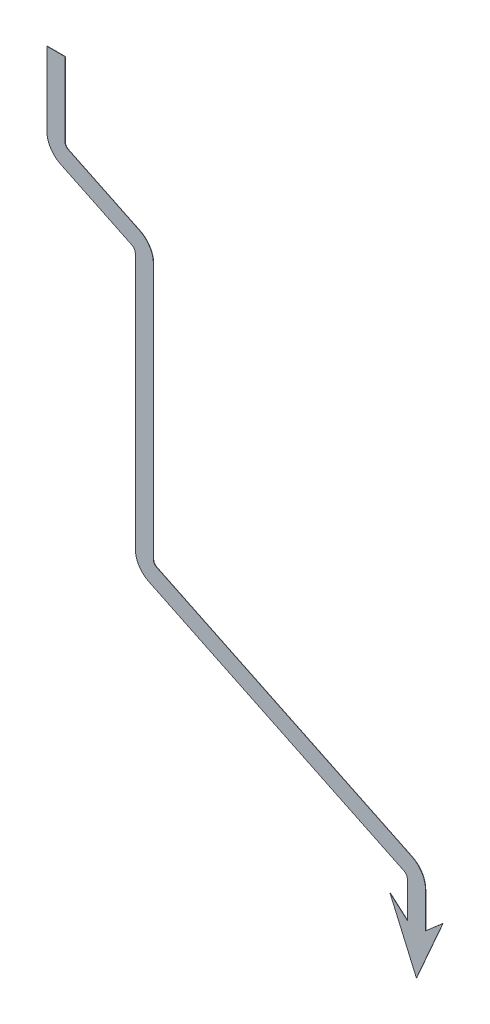
ISO-10303-21;
HEADER;
FILE_DESCRIPTION(('STEP AP214'),'2;1');
FILE_NAME('part.step','',(''),(''),'','','');
FILE_SCHEMA(('AUTOMOTIVE_DESIGN { 1 0 10303 214 1 1 1 1 }'));
ENDSEC;
DATA;
#1=APPLICATION_CONTEXT('core data for automotive mechanical design processes');
#2=APPLICATION_PROTOCOL_DEFINITION('international standard','automotive_design',2000,#1);
#3=PRODUCT_CONTEXT('',#1,'mechanical');
#4=PRODUCT('Part','Part','',(#3));
#5=PRODUCT_RELATED_PRODUCT_CATEGORY('part','',(#4));
#6=PRODUCT_DEFINITION_FORMATION('','',#4);
#7=PRODUCT_DEFINITION_CONTEXT('part definition',#1,'design');
#8=PRODUCT_DEFINITION('design','',#6,#7);
#9=PRODUCT_DEFINITION_SHAPE('','',#8);
#10=(LENGTH_UNIT() NAMED_UNIT(*) SI_UNIT(.MILLI.,.METRE.));
#11=(NAMED_UNIT(*) PLANE_ANGLE_UNIT() SI_UNIT($,.RADIAN.));
#12=(NAMED_UNIT(*) SI_UNIT($,.STERADIAN.) SOLID_ANGLE_UNIT());
#13=UNCERTAINTY_MEASURE_WITH_UNIT(LENGTH_MEASURE(1.E-05),#10,'distance_accuracy_value','');
#14=(GEOMETRIC_REPRESENTATION_CONTEXT(3) GLOBAL_UNCERTAINTY_ASSIGNED_CONTEXT((#13)) GLOBAL_UNIT_ASSIGNED_CONTEXT((#10,
#11,#12)) REPRESENTATION_CONTEXT('',''));
#15=CARTESIAN_POINT('',(0.,0.,0.));
#16=DIRECTION('',(0.,0.,1.));
#17=DIRECTION('',(1.,0.,0.));
#18=AXIS2_PLACEMENT_3D('',#15,#16,#17);
#19=CARTESIAN_POINT('',(170.725807144726,-184.211001687982,0.2));
#20=DIRECTION('',(1.,0.,0.));
#21=DIRECTION('',(0.,1.,0.));
#22=AXIS2_PLACEMENT_3D('',#19,#20,#21);
#23=PLANE('',#22);
#24=DIRECTION('',(0.,-1.,0.));
#25=VECTOR('',#24,1.);
#26=CARTESIAN_POINT('',(170.725807144726,-184.211001687982,0.));
#27=LINE('',#26,#25);
#28=CARTESIAN_POINT('',(170.725807144726,-184.211001687982,0.));
#29=VERTEX_POINT('',#28);
#30=CARTESIAN_POINT('',(170.725807144726,-207.92823917455,0.));
#31=VERTEX_POINT('',#30);
#32=EDGE_CURVE('E219',#29,#31,#27,.T.);
#33=ORIENTED_EDGE('',*,*,#32,.T.);
#34=DIRECTION('',(0.,0.,-1.));
#35=VECTOR('',#34,1.);
#36=CARTESIAN_POINT('',(170.725807144726,-207.92823917455,0.2));
#37=LINE('',#36,#35);
#38=CARTESIAN_POINT('',(170.725807144726,-207.92823917455,0.199999999999999));
#39=VERTEX_POINT('',#38);
#40=EDGE_CURVE('E11',#39,#31,#37,.T.);
#41=ORIENTED_EDGE('',*,*,#40,.F.);
#42=DIRECTION('',(0.,-1.,0.));
#43=VECTOR('',#42,1.);
#44=CARTESIAN_POINT('',(170.725807144726,-184.211001687982,0.2));
#45=LINE('',#44,#43);
#46=CARTESIAN_POINT('',(170.725807144726,-184.211001687982,0.2));
#47=VERTEX_POINT('',#46);
#48=EDGE_CURVE('E272',#47,#39,#45,.T.);
#49=ORIENTED_EDGE('',*,*,#48,.F.);
#50=DIRECTION('',(0.,0.,-1.));
#51=VECTOR('',#50,1.);
#52=CARTESIAN_POINT('',(170.725807144726,-184.211001687982,0.2));
#53=LINE('',#52,#51);
#54=EDGE_CURVE('E317',#47,#29,#53,.T.);
#55=ORIENTED_EDGE('',*,*,#54,.T.);
#56=EDGE_LOOP('',(#33,#41,#49,#55));
#57=FACE_BOUND('',#56,.T.);
#58=ADVANCED_FACE('F33',(#57),#23,.F.);
#59=CARTESIAN_POINT('',(182.725807144726,-184.211001687982,0.2));
#60=DIRECTION('',(1.,0.,0.));
#61=DIRECTION('',(0.,1.,0.));
#62=AXIS2_PLACEMENT_3D('',#59,#60,#61);
#63=PLANE('',#62);
#64=DIRECTION('',(0.,-1.,0.));
#65=VECTOR('',#64,1.);
#66=CARTESIAN_POINT('',(182.725807144726,-184.211001687982,0.));
#67=LINE('',#66,#65);
#68=CARTESIAN_POINT('',(182.725807144726,-184.211001687982,0.));
#69=VERTEX_POINT('',#68);
#70=CARTESIAN_POINT('',(182.725807144726,-207.92823917455,0.));
#71=VERTEX_POINT('',#70);
#72=EDGE_CURVE('E226',#69,#71,#67,.T.);
#73=ORIENTED_EDGE('',*,*,#72,.F.);
#74=DIRECTION('',(0.,0.,-1.));
#75=VECTOR('',#74,1.);
#76=CARTESIAN_POINT('',(182.725807144726,-184.211001687982,0.2));
#77=LINE('',#76,#75);
#78=CARTESIAN_POINT('',(182.725807144726,-184.211001687982,0.2));
#79=VERTEX_POINT('',#78);
#80=EDGE_CURVE('E359',#79,#69,#77,.T.);
#81=ORIENTED_EDGE('',*,*,#80,.F.);
#82=DIRECTION('',(0.,-1.,0.));
#83=VECTOR('',#82,1.);
#84=CARTESIAN_POINT('',(182.725807144726,-184.211001687982,0.2));
#85=LINE('',#84,#83);
#86=CARTESIAN_POINT('',(182.725807144726,-207.92823917455,0.199999999999999));
#87=VERTEX_POINT('',#86);
#88=EDGE_CURVE('E274',#79,#87,#85,.T.);
#89=ORIENTED_EDGE('',*,*,#88,.T.);
#90=DIRECTION('',(0.,0.,-1.));
#91=VECTOR('',#90,1.);
#92=CARTESIAN_POINT('',(182.725807144726,-207.92823917455,0.2));
#93=LINE('',#92,#91);
#94=EDGE_CURVE('E40',#87,#71,#93,.T.);
#95=ORIENTED_EDGE('',*,*,#94,.T.);
#96=EDGE_LOOP('',(#73,#81,#89,#95));
#97=FACE_BOUND('',#96,.T.);
#98=ADVANCED_FACE('F362',(#97),#63,.T.);
#99=CARTESIAN_POINT('',(166.725807144726,-184.211001687982,0.2));
#100=DIRECTION('',(0.,0.,-1.));
#101=DIRECTION('',(-1.,0.,0.));
#102=AXIS2_PLACEMENT_3D('',#99,#100,#101);
#103=CYLINDRICAL_SURFACE('',#102,16.);
#104=CARTESIAN_POINT('',(166.725807144726,-184.211001687982,0.));
#105=DIRECTION('',(0.,0.,1.));
#106=DIRECTION('',(1.,0.,0.));
#107=AXIS2_PLACEMENT_3D('',#104,#105,#106);
#108=CIRCLE('',#107,16.);
#109=CARTESIAN_POINT('',(173.669298684435,-169.796150830689,0.));
#110=VERTEX_POINT('',#109);
#111=EDGE_CURVE('E229',#110,#69,#108,.F.);
#112=ORIENTED_EDGE('',*,*,#111,.F.);
#113=DIRECTION('',(0.,0.,-1.));
#114=VECTOR('',#113,1.);
#115=CARTESIAN_POINT('',(173.669298684435,-169.796150830689,0.2));
#116=LINE('',#115,#114);
#117=CARTESIAN_POINT('',(173.669298684435,-169.796150830689,0.2));
#118=VERTEX_POINT('',#117);
#119=EDGE_CURVE('E357',#118,#110,#116,.T.);
#120=ORIENTED_EDGE('',*,*,#119,.F.);
#121=CARTESIAN_POINT('',(166.725807144726,-184.211001687982,0.2));
#122=DIRECTION('',(0.,0.,1.));
#123=DIRECTION('',(1.,0.,0.));
#124=AXIS2_PLACEMENT_3D('',#121,#122,#123);
#125=CIRCLE('',#124,16.);
#126=EDGE_CURVE('E276',#118,#79,#125,.F.);
#127=ORIENTED_EDGE('',*,*,#126,.T.);
#128=ORIENTED_EDGE('',*,*,#80,.T.);
#129=EDGE_LOOP('',(#112,#120,#127,#128));
#130=FACE_BOUND('',#129,.T.);
#131=ADVANCED_FACE('F369',(#130),#103,.T.);
#132=CARTESIAN_POINT('',(4.80429854364468,-88.4555451290707,0.2));
#133=DIRECTION('',(0.433968221231855,0.900928178580768,0.));
#134=DIRECTION('',(-0.900928178580768,0.433968221231855,0.));
#135=AXIS2_PLACEMENT_3D('',#132,#133,#134);
#136=PLANE('',#135);
#137=DIRECTION('',(0.900928178580768,-0.433968221231855,0.));
#138=VECTOR('',#137,1.);
#139=CARTESIAN_POINT('',(4.80429854364468,-88.4555451290707,0.));
#140=LINE('',#139,#138);
#141=CARTESIAN_POINT('',(4.80429854364469,-88.4555451290707,0.));
#142=VERTEX_POINT('',#141);
#143=EDGE_CURVE('E232',#142,#110,#140,.T.);
#144=ORIENTED_EDGE('',*,*,#143,.F.);
#145=DIRECTION('',(0.,0.,-1.));
#146=VECTOR('',#145,1.);
#147=CARTESIAN_POINT('',(4.80429854364469,-88.4555451290707,0.2));
#148=LINE('',#147,#146);
#149=CARTESIAN_POINT('',(4.80429854364469,-88.4555451290707,0.2));
#150=VERTEX_POINT('',#149);
#151=EDGE_CURVE('E355',#150,#142,#148,.T.);
#152=ORIENTED_EDGE('',*,*,#151,.F.);
#153=DIRECTION('',(0.900928178580768,-0.433968221231855,0.));
#154=VECTOR('',#153,1.);
#155=CARTESIAN_POINT('',(4.80429854364468,-88.4555451290707,0.2));
#156=LINE('',#155,#154);
#157=EDGE_CURVE('E279',#150,#118,#156,.T.);
#158=ORIENTED_EDGE('',*,*,#157,.T.);
#159=ORIENTED_EDGE('',*,*,#119,.T.);
#160=EDGE_LOOP('',(#144,#152,#158,#159));
#161=FACE_BOUND('',#160,.T.);
#162=ADVANCED_FACE('F374',(#161),#136,.T.);
#163=CARTESIAN_POINT('',(6.54017142857211,-84.8518324147476,0.2));
#164=DIRECTION('',(0.,0.,-1.));
#165=DIRECTION('',(-1.,0.,0.));
#166=AXIS2_PLACEMENT_3D('',#163,#164,#165);
#167=CYLINDRICAL_SURFACE('',#166,4.00000000000001);
#168=CARTESIAN_POINT('',(6.54017142857211,-84.8518324147476,0.));
#169=DIRECTION('',(0.,0.,1.));
#170=DIRECTION('',(1.,0.,0.));
#171=AXIS2_PLACEMENT_3D('',#168,#169,#170);
#172=CIRCLE('',#171,4.00000000000001);
#173=CARTESIAN_POINT('',(2.5401714285721,-84.8518324147476,0.));
#174=VERTEX_POINT('',#173);
#175=EDGE_CURVE('E235',#174,#142,#172,.T.);
#176=ORIENTED_EDGE('',*,*,#175,.F.);
#177=DIRECTION('',(0.,0.,-1.));
#178=VECTOR('',#177,1.);
#179=CARTESIAN_POINT('',(2.5401714285721,-84.8518324147476,0.2));
#180=LINE('',#179,#178);
#181=CARTESIAN_POINT('',(2.5401714285721,-84.8518324147476,0.2));
#182=VERTEX_POINT('',#181);
#183=EDGE_CURVE('E353',#182,#174,#180,.T.);
#184=ORIENTED_EDGE('',*,*,#183,.F.);
#185=CARTESIAN_POINT('',(6.54017142857211,-84.8518324147476,0.2));
#186=DIRECTION('',(0.,0.,1.));
#187=DIRECTION('',(1.,0.,0.));
#188=AXIS2_PLACEMENT_3D('',#185,#186,#187);
#189=CIRCLE('',#188,4.00000000000001);
#190=EDGE_CURVE('E282',#182,#150,#189,.T.);
#191=ORIENTED_EDGE('',*,*,#190,.T.);
#192=ORIENTED_EDGE('',*,*,#151,.T.);
#193=EDGE_LOOP('',(#176,#184,#191,#192));
#194=FACE_BOUND('',#193,.T.);
#195=ADVANCED_FACE('F377',(#194),#167,.F.);
#196=CARTESIAN_POINT('',(2.54017142857209,84.6453937828702,0.2));
#197=DIRECTION('',(1.,0.,0.));
#198=DIRECTION('',(0.,1.,0.));
#199=AXIS2_PLACEMENT_3D('',#196,#197,#198);
#200=PLANE('',#199);
#201=DIRECTION('',(0.,-1.,0.));
#202=VECTOR('',#201,1.);
#203=CARTESIAN_POINT('',(2.54017142857209,84.6453937828702,0.));
#204=LINE('',#203,#202);
#205=CARTESIAN_POINT('',(2.54017142857209,84.6453937828702,0.));
#206=VERTEX_POINT('',#205);
#207=EDGE_CURVE('E238',#206,#174,#204,.T.);
#208=ORIENTED_EDGE('',*,*,#207,.F.);
#209=DIRECTION('',(0.,0.,-1.));
#210=VECTOR('',#209,1.);
#211=CARTESIAN_POINT('',(2.54017142857209,84.6453937828702,0.2));
#212=LINE('',#211,#210);
#213=CARTESIAN_POINT('',(2.54017142857209,84.6453937828702,0.2));
#214=VERTEX_POINT('',#213);
#215=EDGE_CURVE('E351',#214,#206,#212,.T.);
#216=ORIENTED_EDGE('',*,*,#215,.F.);
#217=DIRECTION('',(0.,-1.,0.));
#218=VECTOR('',#217,1.);
#219=CARTESIAN_POINT('',(2.54017142857209,84.6453937828702,0.2));
#220=LINE('',#219,#218);
#221=EDGE_CURVE('E285',#214,#182,#220,.T.);
#222=ORIENTED_EDGE('',*,*,#221,.T.);
#223=ORIENTED_EDGE('',*,*,#183,.T.);
#224=EDGE_LOOP('',(#208,#216,#222,#223));
#225=FACE_BOUND('',#224,.T.);
#226=ADVANCED_FACE('F382',(#225),#200,.T.);
#227=CARTESIAN_POINT('',(-13.4598285714286,84.6453937828704,0.2));
#228=DIRECTION('',(0.,0.,-1.));
#229=DIRECTION('',(-1.,0.,0.));
#230=AXIS2_PLACEMENT_3D('',#227,#228,#229);
#231=CYLINDRICAL_SURFACE('',#230,16.0000000000004);
#232=CARTESIAN_POINT('',(-13.4598285714286,84.6453937828704,0.));
#233=DIRECTION('',(0.,0.,1.));
#234=DIRECTION('',(1.,0.,0.));
#235=AXIS2_PLACEMENT_3D('',#232,#233,#234);
#236=CIRCLE('',#235,16.0000000000004);
#237=CARTESIAN_POINT('',(-6.51633703171772,99.0602446401626,0.));
#238=VERTEX_POINT('',#237);
#239=EDGE_CURVE('E241',#238,#206,#236,.F.);
#240=ORIENTED_EDGE('',*,*,#239,.F.);
#241=DIRECTION('',(0.,0.,-1.));
#242=VECTOR('',#241,1.);
#243=CARTESIAN_POINT('',(-6.51633703171772,99.0602446401626,0.2));
#244=LINE('',#243,#242);
#245=CARTESIAN_POINT('',(-6.51633703171772,99.0602446401626,0.2));
#246=VERTEX_POINT('',#245);
#247=EDGE_CURVE('E349',#246,#238,#244,.T.);
#248=ORIENTED_EDGE('',*,*,#247,.F.);
#249=CARTESIAN_POINT('',(-13.4598285714286,84.6453937828704,0.2));
#250=DIRECTION('',(0.,0.,1.));
#251=DIRECTION('',(1.,0.,0.));
#252=AXIS2_PLACEMENT_3D('',#249,#250,#251);
#253=CIRCLE('',#252,16.0000000000004);
#254=EDGE_CURVE('E288',#246,#214,#253,.F.);
#255=ORIENTED_EDGE('',*,*,#254,.T.);
#256=ORIENTED_EDGE('',*,*,#215,.T.);
#257=EDGE_LOOP('',(#240,#248,#255,#256));
#258=FACE_BOUND('',#257,.T.);
#259=ADVANCED_FACE('F385',(#258),#231,.T.);
#260=CARTESIAN_POINT('',(-53.7560330641053,121.815140475481,0.2));
#261=DIRECTION('',(0.433968221231854,0.900928178580768,0.));
#262=DIRECTION('',(-0.900928178580768,0.433968221231854,0.));
#263=AXIS2_PLACEMENT_3D('',#260,#261,#262);
#264=PLANE('',#263);
#265=DIRECTION('',(0.900928178580768,-0.433968221231854,0.));
#266=VECTOR('',#265,1.);
#267=CARTESIAN_POINT('',(-53.7560330641053,121.815140475481,0.));
#268=LINE('',#267,#266);
#269=CARTESIAN_POINT('',(-53.7560330641053,121.815140475481,0.));
#270=VERTEX_POINT('',#269);
#271=EDGE_CURVE('E244',#270,#238,#268,.T.);
#272=ORIENTED_EDGE('',*,*,#271,.F.);
#273=DIRECTION('',(0.,0.,-1.));
#274=VECTOR('',#273,1.);
#275=CARTESIAN_POINT('',(-53.7560330641053,121.815140475481,0.2));
#276=LINE('',#275,#274);
#277=CARTESIAN_POINT('',(-53.7560330641053,121.815140475481,0.2));
#278=VERTEX_POINT('',#277);
#279=EDGE_CURVE('E347',#278,#270,#276,.T.);
#280=ORIENTED_EDGE('',*,*,#279,.F.);
#281=DIRECTION('',(0.900928178580768,-0.433968221231854,0.));
#282=VECTOR('',#281,1.);
#283=CARTESIAN_POINT('',(-53.7560330641053,121.815140475481,0.2));
#284=LINE('',#283,#282);
#285=EDGE_CURVE('E291',#278,#246,#284,.T.);
#286=ORIENTED_EDGE('',*,*,#285,.T.);
#287=ORIENTED_EDGE('',*,*,#247,.T.);
#288=EDGE_LOOP('',(#272,#280,#286,#287));
#289=FACE_BOUND('',#288,.T.);
#290=ADVANCED_FACE('F390',(#289),#264,.T.);
#291=CARTESIAN_POINT('',(-52.0201601791785,125.418853189804,0.2));
#292=DIRECTION('',(0.,0.,-1.));
#293=DIRECTION('',(-1.,0.,0.));
#294=AXIS2_PLACEMENT_3D('',#291,#292,#293);
#295=CYLINDRICAL_SURFACE('',#294,3.99999999999969);
#296=CARTESIAN_POINT('',(-52.0201601791785,125.418853189804,0.));
#297=DIRECTION('',(0.,0.,1.));
#298=DIRECTION('',(1.,0.,0.));
#299=AXIS2_PLACEMENT_3D('',#296,#297,#298);
#300=CIRCLE('',#299,3.99999999999969);
#301=CARTESIAN_POINT('',(-56.0201601791782,125.418853189804,0.));
#302=VERTEX_POINT('',#301);
#303=EDGE_CURVE('E247',#302,#270,#300,.T.);
#304=ORIENTED_EDGE('',*,*,#303,.F.);
#305=DIRECTION('',(0.,0.,-1.));
#306=VECTOR('',#305,1.);
#307=CARTESIAN_POINT('',(-56.0201601791782,125.418853189804,0.2));
#308=LINE('',#307,#306);
#309=CARTESIAN_POINT('',(-56.0201601791782,125.418853189804,0.2));
#310=VERTEX_POINT('',#309);
#311=EDGE_CURVE('E345',#310,#302,#308,.T.);
#312=ORIENTED_EDGE('',*,*,#311,.F.);
#313=CARTESIAN_POINT('',(-52.0201601791785,125.418853189804,0.2));
#314=DIRECTION('',(0.,0.,1.));
#315=DIRECTION('',(1.,0.,0.));
#316=AXIS2_PLACEMENT_3D('',#313,#314,#315);
#317=CIRCLE('',#316,3.99999999999969);
#318=EDGE_CURVE('E294',#310,#278,#317,.T.);
#319=ORIENTED_EDGE('',*,*,#318,.T.);
#320=ORIENTED_EDGE('',*,*,#279,.T.);
#321=EDGE_LOOP('',(#304,#312,#319,#320));
#322=FACE_BOUND('',#321,.T.);
#323=ADVANCED_FACE('F393',(#322),#295,.F.);
#324=CARTESIAN_POINT('',(-56.0201601791779,125.418853189804,0.2));
#325=DIRECTION('',(1.,0.,0.));
#326=DIRECTION('',(0.,1.,0.));
#327=AXIS2_PLACEMENT_3D('',#324,#325,#326);
#328=PLANE('',#327);
#329=DIRECTION('',(0.,-1.,0.));
#330=VECTOR('',#329,1.);
#331=CARTESIAN_POINT('',(-56.0201601791779,125.418853189804,0.));
#332=LINE('',#331,#330);
#333=CARTESIAN_POINT('',(-56.0201601791778,174.136090676372,0.));
#334=VERTEX_POINT('',#333);
#335=EDGE_CURVE('E250',#334,#302,#332,.T.);
#336=ORIENTED_EDGE('',*,*,#335,.F.);
#337=DIRECTION('',(0.,0.,-1.));
#338=VECTOR('',#337,1.);
#339=CARTESIAN_POINT('',(-56.0201601791778,174.136090676372,0.2));
#340=LINE('',#339,#338);
#341=CARTESIAN_POINT('',(-56.0201601791778,174.136090676372,0.2));
#342=VERTEX_POINT('',#341);
#343=EDGE_CURVE('E343',#342,#334,#340,.T.);
#344=ORIENTED_EDGE('',*,*,#343,.F.);
#345=DIRECTION('',(0.,-1.,0.));
#346=VECTOR('',#345,1.);
#347=CARTESIAN_POINT('',(-56.0201601791779,125.418853189804,0.2));
#348=LINE('',#347,#346);
#349=EDGE_CURVE('E297',#342,#310,#348,.T.);
#350=ORIENTED_EDGE('',*,*,#349,.T.);
#351=ORIENTED_EDGE('',*,*,#311,.T.);
#352=EDGE_LOOP('',(#336,#344,#350,#351));
#353=FACE_BOUND('',#352,.T.);
#354=ADVANCED_FACE('F398',(#353),#328,.T.);
#355=CARTESIAN_POINT('',(-68.0201601791778,174.136090676372,0.2));
#356=DIRECTION('',(0.,1.,0.));
#357=DIRECTION('',(0.,0.,1.));
#358=AXIS2_PLACEMENT_3D('',#355,#356,#357);
#359=PLANE('',#358);
#360=DIRECTION('',(1.,0.,0.));
#361=VECTOR('',#360,1.);
#362=CARTESIAN_POINT('',(-68.0201601791778,174.136090676372,0.));
#363=LINE('',#362,#361);
#364=CARTESIAN_POINT('',(-68.0201601791778,174.136090676372,0.));
#365=VERTEX_POINT('',#364);
#366=EDGE_CURVE('E253',#365,#334,#363,.T.);
#367=ORIENTED_EDGE('',*,*,#366,.F.);
#368=DIRECTION('',(0.,0.,-1.));
#369=VECTOR('',#368,1.);
#370=CARTESIAN_POINT('',(-68.0201601791778,174.136090676372,0.2));
#371=LINE('',#370,#369);
#372=CARTESIAN_POINT('',(-68.0201601791778,174.136090676372,0.2));
#373=VERTEX_POINT('',#372);
#374=EDGE_CURVE('E341',#373,#365,#371,.T.);
#375=ORIENTED_EDGE('',*,*,#374,.F.);
#376=DIRECTION('',(1.,0.,0.));
#377=VECTOR('',#376,1.);
#378=CARTESIAN_POINT('',(-68.0201601791778,174.136090676372,0.2));
#379=LINE('',#378,#377);
#380=EDGE_CURVE('E300',#373,#342,#379,.T.);
#381=ORIENTED_EDGE('',*,*,#380,.T.);
#382=ORIENTED_EDGE('',*,*,#343,.T.);
#383=EDGE_LOOP('',(#367,#375,#381,#382));
#384=FACE_BOUND('',#383,.T.);
#385=ADVANCED_FACE('F401',(#384),#359,.T.);
#386=CARTESIAN_POINT('',(-68.0201601791779,125.418853189804,0.2));
#387=DIRECTION('',(1.,0.,0.));
#388=DIRECTION('',(0.,1.,0.));
#389=AXIS2_PLACEMENT_3D('',#386,#387,#388);
#390=PLANE('',#389);
#391=DIRECTION('',(0.,-1.,0.));
#392=VECTOR('',#391,1.);
#393=CARTESIAN_POINT('',(-68.0201601791779,125.418853189804,0.));
#394=LINE('',#393,#392);
#395=CARTESIAN_POINT('',(-68.0201601791782,125.418853189804,0.));
#396=VERTEX_POINT('',#395);
#397=EDGE_CURVE('E256',#365,#396,#394,.T.);
#398=ORIENTED_EDGE('',*,*,#397,.T.);
#399=DIRECTION('',(0.,0.,-1.));
#400=VECTOR('',#399,1.);
#401=CARTESIAN_POINT('',(-68.0201601791782,125.418853189804,0.2));
#402=LINE('',#401,#400);
#403=CARTESIAN_POINT('',(-68.0201601791782,125.418853189804,0.2));
#404=VERTEX_POINT('',#403);
#405=EDGE_CURVE('E338',#404,#396,#402,.T.);
#406=ORIENTED_EDGE('',*,*,#405,.F.);
#407=DIRECTION('',(0.,-1.,0.));
#408=VECTOR('',#407,1.);
#409=CARTESIAN_POINT('',(-68.0201601791779,125.418853189804,0.2));
#410=LINE('',#409,#408);
#411=EDGE_CURVE('E303',#373,#404,#410,.T.);
#412=ORIENTED_EDGE('',*,*,#411,.F.);
#413=ORIENTED_EDGE('',*,*,#374,.T.);
#414=EDGE_LOOP('',(#398,#406,#412,#413));
#415=FACE_BOUND('',#414,.T.);
#416=ADVANCED_FACE('F407',(#415),#390,.F.);
#417=CARTESIAN_POINT('',(-52.0201601791785,125.418853189804,0.2));
#418=DIRECTION('',(0.,0.,-1.));
#419=DIRECTION('',(-1.,0.,0.));
#420=AXIS2_PLACEMENT_3D('',#417,#418,#419);
#421=CYLINDRICAL_SURFACE('',#420,15.9999999999997);
#422=CARTESIAN_POINT('',(-52.0201601791785,125.418853189804,0.));
#423=DIRECTION('',(0.,0.,1.));
#424=DIRECTION('',(1.,0.,0.));
#425=AXIS2_PLACEMENT_3D('',#422,#423,#424);
#426=CIRCLE('',#425,15.9999999999997);
#427=CARTESIAN_POINT('',(-58.9636517188875,111.004002332512,0.));
#428=VERTEX_POINT('',#427);
#429=EDGE_CURVE('E258',#396,#428,#426,.T.);
#430=ORIENTED_EDGE('',*,*,#429,.T.);
#431=DIRECTION('',(0.,0.,-1.));
#432=VECTOR('',#431,1.);
#433=CARTESIAN_POINT('',(-58.9636517188875,111.004002332512,0.2));
#434=LINE('',#433,#432);
#435=CARTESIAN_POINT('',(-58.9636517188875,111.004002332512,0.2));
#436=VERTEX_POINT('',#435);
#437=EDGE_CURVE('E335',#436,#428,#434,.T.);
#438=ORIENTED_EDGE('',*,*,#437,.F.);
#439=CARTESIAN_POINT('',(-52.0201601791785,125.418853189804,0.2));
#440=DIRECTION('',(0.,0.,1.));
#441=DIRECTION('',(1.,0.,0.));
#442=AXIS2_PLACEMENT_3D('',#439,#440,#441);
#443=CIRCLE('',#442,15.9999999999997);
#444=EDGE_CURVE('E305',#404,#436,#443,.T.);
#445=ORIENTED_EDGE('',*,*,#444,.F.);
#446=ORIENTED_EDGE('',*,*,#405,.T.);
#447=EDGE_LOOP('',(#430,#438,#445,#446));
#448=FACE_BOUND('',#447,.T.);
#449=ADVANCED_FACE('F411',(#448),#421,.T.);
#450=CARTESIAN_POINT('',(-58.9636517188875,111.004002332512,0.2));
#451=DIRECTION('',(0.433968221231854,0.900928178580768,0.));
#452=DIRECTION('',(-0.900928178580768,0.433968221231854,0.));
#453=AXIS2_PLACEMENT_3D('',#450,#451,#452);
#454=PLANE('',#453);
#455=DIRECTION('',(0.900928178580768,-0.433968221231854,0.));
#456=VECTOR('',#455,1.);
#457=CARTESIAN_POINT('',(-58.9636517188875,111.004002332512,0.));
#458=LINE('',#457,#456);
#459=CARTESIAN_POINT('',(-11.7239556865007,88.2491064971937,0.));
#460=VERTEX_POINT('',#459);
#461=EDGE_CURVE('E260',#428,#460,#458,.T.);
#462=ORIENTED_EDGE('',*,*,#461,.T.);
#463=DIRECTION('',(0.,0.,-1.));
#464=VECTOR('',#463,1.);
#465=CARTESIAN_POINT('',(-11.7239556865007,88.2491064971937,0.2));
#466=LINE('',#465,#464);
#467=CARTESIAN_POINT('',(-11.7239556865007,88.2491064971937,0.2));
#468=VERTEX_POINT('',#467);
#469=EDGE_CURVE('E332',#468,#460,#466,.T.);
#470=ORIENTED_EDGE('',*,*,#469,.F.);
#471=DIRECTION('',(0.900928178580768,-0.433968221231854,0.));
#472=VECTOR('',#471,1.);
#473=CARTESIAN_POINT('',(-58.9636517188875,111.004002332512,0.2));
#474=LINE('',#473,#472);
#475=EDGE_CURVE('E307',#436,#468,#474,.T.);
#476=ORIENTED_EDGE('',*,*,#475,.F.);
#477=ORIENTED_EDGE('',*,*,#437,.T.);
#478=EDGE_LOOP('',(#462,#470,#476,#477));
#479=FACE_BOUND('',#478,.T.);
#480=ADVANCED_FACE('F416',(#479),#454,.F.);
#481=CARTESIAN_POINT('',(-13.4598285714286,84.6453937828704,0.2));
#482=DIRECTION('',(0.,0.,-1.));
#483=DIRECTION('',(-1.,0.,0.));
#484=AXIS2_PLACEMENT_3D('',#481,#482,#483);
#485=CYLINDRICAL_SURFACE('',#484,4.00000000000036);
#486=CARTESIAN_POINT('',(-13.4598285714286,84.6453937828704,0.));
#487=DIRECTION('',(0.,0.,1.));
#488=DIRECTION('',(1.,0.,0.));
#489=AXIS2_PLACEMENT_3D('',#486,#487,#488);
#490=CIRCLE('',#489,4.00000000000036);
#491=CARTESIAN_POINT('',(-9.45982857142791,84.6453937828702,0.));
#492=VERTEX_POINT('',#491);
#493=EDGE_CURVE('E262',#460,#492,#490,.F.);
#494=ORIENTED_EDGE('',*,*,#493,.T.);
#495=DIRECTION('',(0.,0.,-1.));
#496=VECTOR('',#495,1.);
#497=CARTESIAN_POINT('',(-9.45982857142791,84.6453937828702,0.2));
#498=LINE('',#497,#496);
#499=CARTESIAN_POINT('',(-9.45982857142791,84.6453937828702,0.2));
#500=VERTEX_POINT('',#499);
#501=EDGE_CURVE('E329',#500,#492,#498,.T.);
#502=ORIENTED_EDGE('',*,*,#501,.F.);
#503=CARTESIAN_POINT('',(-13.4598285714286,84.6453937828704,0.2));
#504=DIRECTION('',(0.,0.,1.));
#505=DIRECTION('',(1.,0.,0.));
#506=AXIS2_PLACEMENT_3D('',#503,#504,#505);
#507=CIRCLE('',#506,4.00000000000036);
#508=EDGE_CURVE('E309',#468,#500,#507,.F.);
#509=ORIENTED_EDGE('',*,*,#508,.F.);
#510=ORIENTED_EDGE('',*,*,#469,.T.);
#511=EDGE_LOOP('',(#494,#502,#509,#510));
#512=FACE_BOUND('',#511,.T.);
#513=ADVANCED_FACE('F422',(#512),#485,.F.);
#514=CARTESIAN_POINT('',(-9.45982857142791,84.6453937828702,0.2));
#515=DIRECTION('',(1.,0.,0.));
#516=DIRECTION('',(0.,1.,0.));
#517=AXIS2_PLACEMENT_3D('',#514,#515,#516);
#518=PLANE('',#517);
#519=DIRECTION('',(0.,-1.,0.));
#520=VECTOR('',#519,1.);
#521=CARTESIAN_POINT('',(-9.45982857142791,84.6453937828702,0.));
#522=LINE('',#521,#520);
#523=CARTESIAN_POINT('',(-9.4598285714279,-84.8518324147476,0.));
#524=VERTEX_POINT('',#523);
#525=EDGE_CURVE('E264',#492,#524,#522,.T.);
#526=ORIENTED_EDGE('',*,*,#525,.T.);
#527=DIRECTION('',(0.,0.,-1.));
#528=VECTOR('',#527,1.);
#529=CARTESIAN_POINT('',(-9.4598285714279,-84.8518324147476,0.2));
#530=LINE('',#529,#528);
#531=CARTESIAN_POINT('',(-9.4598285714279,-84.8518324147476,0.2));
#532=VERTEX_POINT('',#531);
#533=EDGE_CURVE('E326',#532,#524,#530,.T.);
#534=ORIENTED_EDGE('',*,*,#533,.F.);
#535=DIRECTION('',(0.,-1.,0.));
#536=VECTOR('',#535,1.);
#537=CARTESIAN_POINT('',(-9.45982857142791,84.6453937828702,0.2));
#538=LINE('',#537,#536);
#539=EDGE_CURVE('E311',#500,#532,#538,.T.);
#540=ORIENTED_EDGE('',*,*,#539,.F.);
#541=ORIENTED_EDGE('',*,*,#501,.T.);
#542=EDGE_LOOP('',(#526,#534,#540,#541));
#543=FACE_BOUND('',#542,.T.);
#544=ADVANCED_FACE('F426',(#543),#518,.F.);
#545=CARTESIAN_POINT('',(6.54017142857211,-84.8518324147476,0.2));
#546=DIRECTION('',(0.,0.,-1.));
#547=DIRECTION('',(-1.,0.,0.));
#548=AXIS2_PLACEMENT_3D('',#545,#546,#547);
#549=CYLINDRICAL_SURFACE('',#548,16.);
#550=CARTESIAN_POINT('',(6.54017142857211,-84.8518324147476,0.));
#551=DIRECTION('',(0.,0.,1.));
#552=DIRECTION('',(1.,0.,0.));
#553=AXIS2_PLACEMENT_3D('',#550,#551,#552);
#554=CIRCLE('',#553,16.);
#555=CARTESIAN_POINT('',(-0.403320111137566,-99.2666832720399,0.));
#556=VERTEX_POINT('',#555);
#557=EDGE_CURVE('E266',#524,#556,#554,.T.);
#558=ORIENTED_EDGE('',*,*,#557,.T.);
#559=DIRECTION('',(0.,0.,-1.));
#560=VECTOR('',#559,1.);
#561=CARTESIAN_POINT('',(-0.403320111137566,-99.2666832720399,0.2));
#562=LINE('',#561,#560);
#563=CARTESIAN_POINT('',(-0.403320111137566,-99.2666832720399,0.2));
#564=VERTEX_POINT('',#563);
#565=EDGE_CURVE('E323',#564,#556,#562,.T.);
#566=ORIENTED_EDGE('',*,*,#565,.F.);
#567=CARTESIAN_POINT('',(6.54017142857211,-84.8518324147476,0.2));
#568=DIRECTION('',(0.,0.,1.));
#569=DIRECTION('',(1.,0.,0.));
#570=AXIS2_PLACEMENT_3D('',#567,#568,#569);
#571=CIRCLE('',#570,16.);
#572=EDGE_CURVE('E313',#532,#564,#571,.T.);
#573=ORIENTED_EDGE('',*,*,#572,.F.);
#574=ORIENTED_EDGE('',*,*,#533,.T.);
#575=EDGE_LOOP('',(#558,#566,#573,#574));
#576=FACE_BOUND('',#575,.T.);
#577=ADVANCED_FACE('F431',(#576),#549,.T.);
#578=CARTESIAN_POINT('',(-0.403320111137573,-99.2666832720399,0.2));
#579=DIRECTION('',(0.433968221231855,0.900928178580768,0.));
#580=DIRECTION('',(-0.900928178580768,0.433968221231855,0.));
#581=AXIS2_PLACEMENT_3D('',#578,#579,#580);
#582=PLANE('',#581);
#583=DIRECTION('',(0.900928178580768,-0.433968221231855,0.));
#584=VECTOR('',#583,1.);
#585=CARTESIAN_POINT('',(-0.403320111137573,-99.2666832720399,0.));
#586=LINE('',#585,#584);
#587=CARTESIAN_POINT('',(168.461680029653,-180.607288973659,0.));
#588=VERTEX_POINT('',#587);
#589=EDGE_CURVE('E268',#556,#588,#586,.T.);
#590=ORIENTED_EDGE('',*,*,#589,.T.);
#591=DIRECTION('',(0.,0.,-1.));
#592=VECTOR('',#591,1.);
#593=CARTESIAN_POINT('',(168.461680029653,-180.607288973659,0.2));
#594=LINE('',#593,#592);
#595=CARTESIAN_POINT('',(168.461680029653,-180.607288973659,0.2));
#596=VERTEX_POINT('',#595);
#597=EDGE_CURVE('E320',#596,#588,#594,.T.);
#598=ORIENTED_EDGE('',*,*,#597,.F.);
#599=DIRECTION('',(0.900928178580768,-0.433968221231855,0.));
#600=VECTOR('',#599,1.);
#601=CARTESIAN_POINT('',(-0.403320111137573,-99.2666832720399,0.2));
#602=LINE('',#601,#600);
#603=EDGE_CURVE('E52',#564,#596,#602,.T.);
#604=ORIENTED_EDGE('',*,*,#603,.F.);
#605=ORIENTED_EDGE('',*,*,#565,.T.);
#606=EDGE_LOOP('',(#590,#598,#604,#605));
#607=FACE_BOUND('',#606,.T.);
#608=ADVANCED_FACE('F434',(#607),#582,.F.);
#609=CARTESIAN_POINT('',(166.725807144726,-184.211001687982,0.2));
#610=DIRECTION('',(0.,0.,-1.));
#611=DIRECTION('',(-1.,0.,0.));
#612=AXIS2_PLACEMENT_3D('',#609,#610,#611);
#613=CYLINDRICAL_SURFACE('',#612,4.00000000000002);
#614=CARTESIAN_POINT('',(166.725807144726,-184.211001687982,0.));
#615=DIRECTION('',(0.,0.,1.));
#616=DIRECTION('',(1.,0.,0.));
#617=AXIS2_PLACEMENT_3D('',#614,#615,#616);
#618=CIRCLE('',#617,4.00000000000002);
#619=EDGE_CURVE('E270',#588,#29,#618,.F.);
#620=ORIENTED_EDGE('',*,*,#619,.T.);
#621=ORIENTED_EDGE('',*,*,#54,.F.);
#622=CARTESIAN_POINT('',(166.725807144726,-184.211001687982,0.2));
#623=DIRECTION('',(0.,0.,1.));
#624=DIRECTION('',(1.,0.,0.));
#625=AXIS2_PLACEMENT_3D('',#622,#623,#624);
#626=CIRCLE('',#625,4.00000000000002);
#627=EDGE_CURVE('E47',#596,#47,#626,.F.);
#628=ORIENTED_EDGE('',*,*,#627,.F.);
#629=ORIENTED_EDGE('',*,*,#597,.T.);
#630=EDGE_LOOP('',(#620,#621,#628,#629));
#631=FACE_BOUND('',#630,.T.);
#632=ADVANCED_FACE('F437',(#631),#613,.F.);
#633=CARTESIAN_POINT('',(166.725807144726,-184.211001687982,0.2));
#634=DIRECTION('',(0.,0.,1.));
#635=DIRECTION('',(1.,0.,0.));
#636=AXIS2_PLACEMENT_3D('',#633,#634,#635);
#637=PLANE('',#636);
#638=ORIENTED_EDGE('',*,*,#48,.T.);
#639=DIRECTION('',(0.754605522163505,-0.656178714924787,0.));
#640=VECTOR('',#639,1.);
#641=CARTESIAN_POINT('',(170.725807144726,-207.92823917455,0.199999999999999));
#642=LINE('',#641,#640);
#643=CARTESIAN_POINT('',(159.225807144726,-197.92823917455,0.199999999999999));
#644=VERTEX_POINT('',#643);
#645=EDGE_CURVE('E217',#644,#39,#642,.T.);
#646=ORIENTED_EDGE('',*,*,#645,.F.);
#647=DIRECTION('',(-0.400818834019708,0.916157334902189,0.));
#648=VECTOR('',#647,1.);
#649=CARTESIAN_POINT('',(159.225807144726,-197.92823917455,0.199999999999999));
#650=LINE('',#649,#648);
#651=CARTESIAN_POINT('',(176.725807144726,-237.92823917455,0.199999999999999));
#652=VERTEX_POINT('',#651);
#653=EDGE_CURVE('E193',#652,#644,#650,.T.);
#654=ORIENTED_EDGE('',*,*,#653,.F.);
#655=DIRECTION('',(-0.400818834019708,-0.916157334902189,0.));
#656=VECTOR('',#655,1.);
#657=CARTESIAN_POINT('',(194.225807144726,-197.92823917455,0.199999999999999));
#658=LINE('',#657,#656);
#659=CARTESIAN_POINT('',(194.225807144726,-197.92823917455,0.199999999999999));
#660=VERTEX_POINT('',#659);
#661=EDGE_CURVE('E185',#660,#652,#658,.T.);
#662=ORIENTED_EDGE('',*,*,#661,.F.);
#663=DIRECTION('',(0.754605522163505,0.656178714924787,0.));
#664=VECTOR('',#663,1.);
#665=CARTESIAN_POINT('',(182.725807144726,-207.92823917455,0.199999999999999));
#666=LINE('',#665,#664);
#667=EDGE_CURVE('E190',#87,#660,#666,.T.);
#668=ORIENTED_EDGE('',*,*,#667,.F.);
#669=ORIENTED_EDGE('',*,*,#88,.F.);
#670=ORIENTED_EDGE('',*,*,#126,.F.);
#671=ORIENTED_EDGE('',*,*,#157,.F.);
#672=ORIENTED_EDGE('',*,*,#190,.F.);
#673=ORIENTED_EDGE('',*,*,#221,.F.);
#674=ORIENTED_EDGE('',*,*,#254,.F.);
#675=ORIENTED_EDGE('',*,*,#285,.F.);
#676=ORIENTED_EDGE('',*,*,#318,.F.);
#677=ORIENTED_EDGE('',*,*,#349,.F.);
#678=ORIENTED_EDGE('',*,*,#380,.F.);
#679=ORIENTED_EDGE('',*,*,#411,.T.);
#680=ORIENTED_EDGE('',*,*,#444,.T.);
#681=ORIENTED_EDGE('',*,*,#475,.T.);
#682=ORIENTED_EDGE('',*,*,#508,.T.);
#683=ORIENTED_EDGE('',*,*,#539,.T.);
#684=ORIENTED_EDGE('',*,*,#572,.T.);
#685=ORIENTED_EDGE('',*,*,#603,.T.);
#686=ORIENTED_EDGE('',*,*,#627,.T.);
#687=EDGE_LOOP('',(#638,#646,#654,#662,#668,#669,#670,#671,#672,#673,#674,#675,#676,#677,#678,
#679,#680,#681,#682,#683,#684,#685,#686));
#688=FACE_BOUND('',#687,.T.);
#689=ADVANCED_FACE('F187',(#688),#637,.T.);
#690=CARTESIAN_POINT('',(166.725807144726,-184.211001687982,0.));
#691=DIRECTION('',(0.,0.,1.));
#692=DIRECTION('',(1.,0.,0.));
#693=AXIS2_PLACEMENT_3D('',#690,#691,#692);
#694=PLANE('',#693);
#695=ORIENTED_EDGE('',*,*,#32,.F.);
#696=ORIENTED_EDGE('',*,*,#619,.F.);
#697=ORIENTED_EDGE('',*,*,#589,.F.);
#698=ORIENTED_EDGE('',*,*,#557,.F.);
#699=ORIENTED_EDGE('',*,*,#525,.F.);
#700=ORIENTED_EDGE('',*,*,#493,.F.);
#701=ORIENTED_EDGE('',*,*,#461,.F.);
#702=ORIENTED_EDGE('',*,*,#429,.F.);
#703=ORIENTED_EDGE('',*,*,#397,.F.);
#704=ORIENTED_EDGE('',*,*,#366,.T.);
#705=ORIENTED_EDGE('',*,*,#335,.T.);
#706=ORIENTED_EDGE('',*,*,#303,.T.);
#707=ORIENTED_EDGE('',*,*,#271,.T.);
#708=ORIENTED_EDGE('',*,*,#239,.T.);
#709=ORIENTED_EDGE('',*,*,#207,.T.);
#710=ORIENTED_EDGE('',*,*,#175,.T.);
#711=ORIENTED_EDGE('',*,*,#143,.T.);
#712=ORIENTED_EDGE('',*,*,#111,.T.);
#713=ORIENTED_EDGE('',*,*,#72,.T.);
#714=DIRECTION('',(0.754605522163505,0.656178714924787,0.));
#715=VECTOR('',#714,1.);
#716=CARTESIAN_POINT('',(182.725807144726,-207.92823917455,0.));
#717=LINE('',#716,#715);
#718=CARTESIAN_POINT('',(194.225807144726,-197.92823917455,0.));
#719=VERTEX_POINT('',#718);
#720=EDGE_CURVE('E215',#71,#719,#717,.T.);
#721=ORIENTED_EDGE('',*,*,#720,.T.);
#722=DIRECTION('',(-0.400818834019708,-0.916157334902189,0.));
#723=VECTOR('',#722,1.);
#724=CARTESIAN_POINT('',(194.225807144726,-197.92823917455,0.));
#725=LINE('',#724,#723);
#726=CARTESIAN_POINT('',(176.725807144726,-237.92823917455,0.));
#727=VERTEX_POINT('',#726);
#728=EDGE_CURVE('E202',#719,#727,#725,.T.);
#729=ORIENTED_EDGE('',*,*,#728,.T.);
#730=DIRECTION('',(-0.400818834019708,0.916157334902189,0.));
#731=VECTOR('',#730,1.);
#732=CARTESIAN_POINT('',(159.225807144726,-197.92823917455,0.));
#733=LINE('',#732,#731);
#734=CARTESIAN_POINT('',(159.225807144726,-197.92823917455,0.));
#735=VERTEX_POINT('',#734);
#736=EDGE_CURVE('E211',#727,#735,#733,.T.);
#737=ORIENTED_EDGE('',*,*,#736,.T.);
#738=DIRECTION('',(0.754605522163505,-0.656178714924787,0.));
#739=VECTOR('',#738,1.);
#740=CARTESIAN_POINT('',(170.725807144726,-207.92823917455,0.));
#741=LINE('',#740,#739);
#742=EDGE_CURVE('E209',#735,#31,#741,.T.);
#743=ORIENTED_EDGE('',*,*,#742,.T.);
#744=EDGE_LOOP('',(#695,#696,#697,#698,#699,#700,#701,#702,#703,#704,#705,#706,#707,#708,#709,
#710,#711,#712,#713,#721,#729,#737,#743));
#745=FACE_BOUND('',#744,.T.);
#746=ADVANCED_FACE('F365',(#745),#694,.F.);
#747=CARTESIAN_POINT('',(182.725807144726,-207.92823917455,53.3507290636733));
#748=DIRECTION('',(-0.656178714924787,0.754605522163505,0.));
#749=DIRECTION('',(-0.754605522163505,-0.656178714924787,0.));
#750=AXIS2_PLACEMENT_3D('',#747,#748,#749);
#751=PLANE('',#750);
#752=ORIENTED_EDGE('',*,*,#94,.F.);
#753=ORIENTED_EDGE('',*,*,#667,.T.);
#754=DIRECTION('',(0.,0.,-1.));
#755=VECTOR('',#754,1.);
#756=CARTESIAN_POINT('',(194.225807144726,-197.92823917455,53.3507290636733));
#757=LINE('',#756,#755);
#758=EDGE_CURVE('E197',#660,#719,#757,.T.);
#759=ORIENTED_EDGE('',*,*,#758,.T.);
#760=ORIENTED_EDGE('',*,*,#720,.F.);
#761=EDGE_LOOP('',(#752,#753,#759,#760));
#762=FACE_BOUND('',#761,.T.);
#763=ADVANCED_FACE('F206',(#762),#751,.T.);
#764=CARTESIAN_POINT('',(194.225807144726,-197.92823917455,53.3507290636733));
#765=DIRECTION('',(0.916157334902189,-0.400818834019708,0.));
#766=DIRECTION('',(0.400818834019708,0.916157334902189,0.));
#767=AXIS2_PLACEMENT_3D('',#764,#765,#766);
#768=PLANE('',#767);
#769=ORIENTED_EDGE('',*,*,#758,.F.);
#770=ORIENTED_EDGE('',*,*,#661,.T.);
#771=DIRECTION('',(0.,0.,-1.));
#772=VECTOR('',#771,1.);
#773=CARTESIAN_POINT('',(176.725807144726,-237.92823917455,53.3507290636733));
#774=LINE('',#773,#772);
#775=EDGE_CURVE('E196',#652,#727,#774,.T.);
#776=ORIENTED_EDGE('',*,*,#775,.T.);
#777=ORIENTED_EDGE('',*,*,#728,.F.);
#778=EDGE_LOOP('',(#769,#770,#776,#777));
#779=FACE_BOUND('',#778,.T.);
#780=ADVANCED_FACE('F200',(#779),#768,.T.);
#781=CARTESIAN_POINT('',(159.225807144726,-197.92823917455,53.3507290636733));
#782=DIRECTION('',(-0.916157334902189,-0.400818834019708,0.));
#783=DIRECTION('',(0.400818834019708,-0.916157334902189,0.));
#784=AXIS2_PLACEMENT_3D('',#781,#782,#783);
#785=PLANE('',#784);
#786=ORIENTED_EDGE('',*,*,#775,.F.);
#787=ORIENTED_EDGE('',*,*,#653,.T.);
#788=DIRECTION('',(0.,0.,-1.));
#789=VECTOR('',#788,1.);
#790=CARTESIAN_POINT('',(159.225807144726,-197.92823917455,53.3507290636733));
#791=LINE('',#790,#789);
#792=EDGE_CURVE('E220',#644,#735,#791,.T.);
#793=ORIENTED_EDGE('',*,*,#792,.T.);
#794=ORIENTED_EDGE('',*,*,#736,.F.);
#795=EDGE_LOOP('',(#786,#787,#793,#794));
#796=FACE_BOUND('',#795,.T.);
#797=ADVANCED_FACE('F448',(#796),#785,.T.);
#798=CARTESIAN_POINT('',(170.725807144726,-207.92823917455,53.3507290636733));
#799=DIRECTION('',(0.656178714924787,0.754605522163505,0.));
#800=DIRECTION('',(-0.754605522163505,0.656178714924787,0.));
#801=AXIS2_PLACEMENT_3D('',#798,#799,#800);
#802=PLANE('',#801);
#803=ORIENTED_EDGE('',*,*,#792,.F.);
#804=ORIENTED_EDGE('',*,*,#645,.T.);
#805=ORIENTED_EDGE('',*,*,#40,.T.);
#806=ORIENTED_EDGE('',*,*,#742,.F.);
#807=EDGE_LOOP('',(#803,#804,#805,#806));
#808=FACE_BOUND('',#807,.T.);
#809=ADVANCED_FACE('F444',(#808),#802,.T.);
#810=CLOSED_SHELL('',(#58,#98,#131,#162,#195,#226,#259,#290,#323,#354,#385,#416,#449,#480,#513,
#544,#577,#608,#632,#689,#746,#763,#780,#797,#809));
#811=MANIFOLD_SOLID_BREP('B2',#810);
#812=ADVANCED_BREP_SHAPE_REPRESENTATION('',(#18,#811),#14);
#813=SHAPE_DEFINITION_REPRESENTATION(#9,#812);
ENDSEC;
END-ISO-10303-21;
